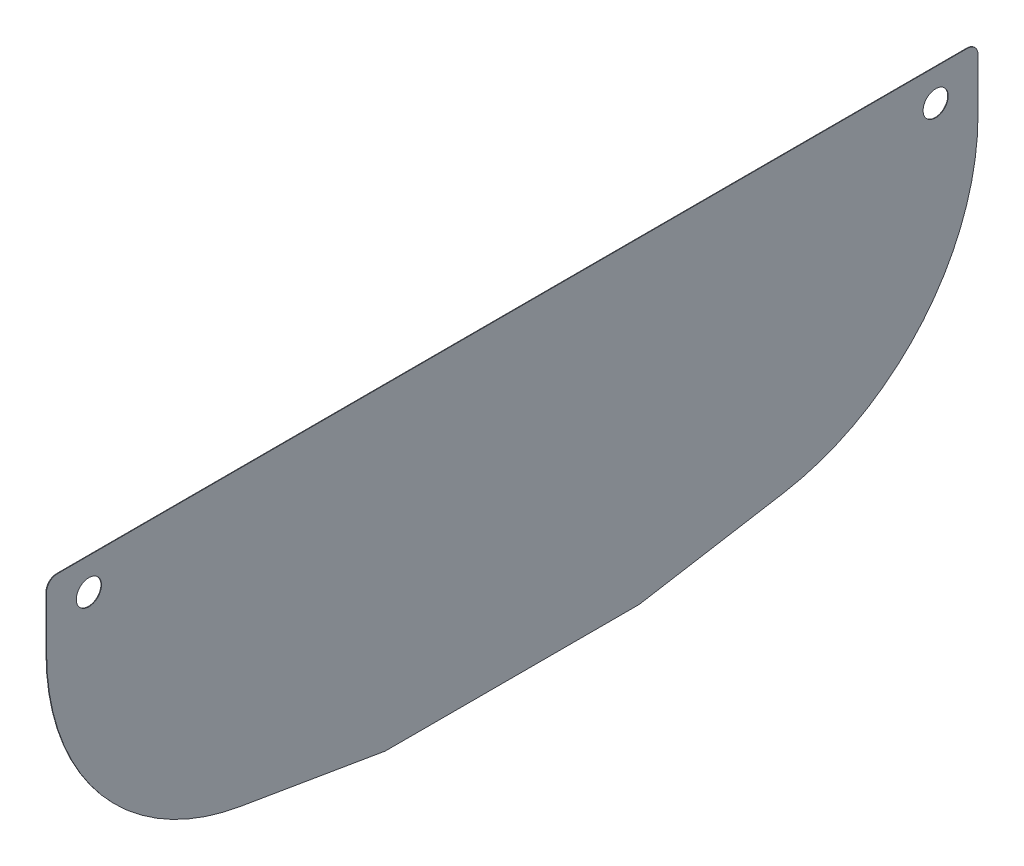
ISO-10303-21;
HEADER;
FILE_DESCRIPTION(('STEP AP214'),'2;1');
FILE_NAME('part.step','',(''),(''),'','','');
FILE_SCHEMA(('AUTOMOTIVE_DESIGN { 1 0 10303 214 1 1 1 1 }'));
ENDSEC;
DATA;
#1=APPLICATION_CONTEXT('core data for automotive mechanical design processes');
#2=APPLICATION_PROTOCOL_DEFINITION('international standard','automotive_design',2000,#1);
#3=PRODUCT_CONTEXT('',#1,'mechanical');
#4=PRODUCT('Part','Part','',(#3));
#5=PRODUCT_RELATED_PRODUCT_CATEGORY('part','',(#4));
#6=PRODUCT_DEFINITION_FORMATION('','',#4);
#7=PRODUCT_DEFINITION_CONTEXT('part definition',#1,'design');
#8=PRODUCT_DEFINITION('design','',#6,#7);
#9=PRODUCT_DEFINITION_SHAPE('','',#8);
#10=(LENGTH_UNIT() NAMED_UNIT(*) SI_UNIT(.MILLI.,.METRE.));
#11=(NAMED_UNIT(*) PLANE_ANGLE_UNIT() SI_UNIT($,.RADIAN.));
#12=(NAMED_UNIT(*) SI_UNIT($,.STERADIAN.) SOLID_ANGLE_UNIT());
#13=UNCERTAINTY_MEASURE_WITH_UNIT(LENGTH_MEASURE(1.E-05),#10,'distance_accuracy_value','');
#14=(GEOMETRIC_REPRESENTATION_CONTEXT(3) GLOBAL_UNCERTAINTY_ASSIGNED_CONTEXT((#13)) GLOBAL_UNIT_ASSIGNED_CONTEXT((#10,
#11,#12)) REPRESENTATION_CONTEXT('',''));
#15=CARTESIAN_POINT('',(0.,0.,0.));
#16=DIRECTION('',(0.,0.,1.));
#17=DIRECTION('',(1.,0.,0.));
#18=AXIS2_PLACEMENT_3D('',#15,#16,#17);
#19=CARTESIAN_POINT('',(0.635,609.6,-279.4));
#20=DIRECTION('',(1.,0.,0.));
#21=DIRECTION('',(0.,0.,-1.));
#22=AXIS2_PLACEMENT_3D('',#19,#20,#21);
#23=PLANE('',#22);
#24=CARTESIAN_POINT('',(0.635,647.7,508.));
#25=DIRECTION('',(1.,0.,0.));
#26=DIRECTION('',(0.,0.,-1.));
#27=AXIS2_PLACEMENT_3D('',#24,#25,#26);
#28=CIRCLE('',#27,15.08125);
#29=CARTESIAN_POINT('',(0.635,647.7,492.91875));
#30=VERTEX_POINT('',#29);
#31=EDGE_CURVE('E240',#30,#30,#28,.T.);
#32=ORIENTED_EDGE('',*,*,#31,.F.);
#33=EDGE_LOOP('',(#32));
#34=FACE_BOUND('',#33,.T.);
#35=DIRECTION('',(0.,0.,-1.));
#36=VECTOR('',#35,1.);
#37=CARTESIAN_POINT('',(0.635,304.8,-152.4));
#38=LINE('',#37,#36);
#39=CARTESIAN_POINT('',(0.635,304.8,151.335296477196));
#40=VERTEX_POINT('',#39);
#41=CARTESIAN_POINT('',(0.635,304.8,-151.335296477196));
#42=VERTEX_POINT('',#41);
#43=EDGE_CURVE('E233',#40,#42,#38,.T.);
#44=ORIENTED_EDGE('',*,*,#43,.T.);
#45=CARTESIAN_POINT('',(0.635,317.5,-151.335296477196));
#46=DIRECTION('',(1.,0.,0.));
#47=DIRECTION('',(0.,0.,-1.));
#48=AXIS2_PLACEMENT_3D('',#45,#46,#47);
#49=CIRCLE('',#48,12.7);
#50=CARTESIAN_POINT('',(0.635,304.977272750754,-153.449841875385));
#51=VERTEX_POINT('',#50);
#52=EDGE_CURVE('E179',#42,#51,#49,.T.);
#53=ORIENTED_EDGE('',*,*,#52,.T.);
#54=DIRECTION('',(0.,0.166499637652699,-0.986041515688625));
#55=VECTOR('',#54,1.);
#56=CARTESIAN_POINT('',(0.635,304.8,-152.4));
#57=LINE('',#56,#55);
#58=CARTESIAN_POINT('',(0.635,334.100000516598,-325.919998760164));
#59=VERTEX_POINT('',#58);
#60=EDGE_CURVE('E142',#51,#59,#57,.T.);
#61=ORIENTED_EDGE('',*,*,#60,.T.);
#62=CARTESIAN_POINT('',(0.635,609.6,-279.4));
#63=DIRECTION('',(1.,0.,0.));
#64=DIRECTION('',(0.,0.,-1.));
#65=AXIS2_PLACEMENT_3D('',#62,#63,#64);
#66=CIRCLE('',#65,279.4);
#67=CARTESIAN_POINT('',(0.635,609.6,-558.8));
#68=VERTEX_POINT('',#67);
#69=EDGE_CURVE('E136',#59,#68,#66,.T.);
#70=ORIENTED_EDGE('',*,*,#69,.T.);
#71=DIRECTION('',(0.,1.,0.));
#72=VECTOR('',#71,1.);
#73=CARTESIAN_POINT('',(0.635,685.8,-558.8));
#74=LINE('',#73,#72);
#75=CARTESIAN_POINT('',(0.635,673.1,-558.8));
#76=VERTEX_POINT('',#75);
#77=EDGE_CURVE('E126',#68,#76,#74,.T.);
#78=ORIENTED_EDGE('',*,*,#77,.T.);
#79=CARTESIAN_POINT('',(0.635,673.1,-546.1));
#80=DIRECTION('',(1.,0.,0.));
#81=DIRECTION('',(0.,0.,-1.));
#82=AXIS2_PLACEMENT_3D('',#79,#80,#81);
#83=CIRCLE('',#82,12.7);
#84=CARTESIAN_POINT('',(0.635,685.8,-546.1));
#85=VERTEX_POINT('',#84);
#86=EDGE_CURVE('E175',#76,#85,#83,.T.);
#87=ORIENTED_EDGE('',*,*,#86,.T.);
#88=DIRECTION('',(0.,0.,1.));
#89=VECTOR('',#88,1.);
#90=CARTESIAN_POINT('',(0.635,685.8,558.8));
#91=LINE('',#90,#89);
#92=CARTESIAN_POINT('',(0.635,685.8,546.1));
#93=VERTEX_POINT('',#92);
#94=EDGE_CURVE('E135',#85,#93,#91,.T.);
#95=ORIENTED_EDGE('',*,*,#94,.T.);
#96=CARTESIAN_POINT('',(0.635,673.1,546.1));
#97=DIRECTION('',(1.,0.,0.));
#98=DIRECTION('',(0.,0.,-1.));
#99=AXIS2_PLACEMENT_3D('',#96,#97,#98);
#100=CIRCLE('',#99,12.7);
#101=CARTESIAN_POINT('',(0.635,673.1,558.8));
#102=VERTEX_POINT('',#101);
#103=EDGE_CURVE('E57',#93,#102,#100,.T.);
#104=ORIENTED_EDGE('',*,*,#103,.T.);
#105=DIRECTION('',(0.,-1.,0.));
#106=VECTOR('',#105,1.);
#107=CARTESIAN_POINT('',(0.635,609.6,558.8));
#108=LINE('',#107,#106);
#109=CARTESIAN_POINT('',(0.635,609.6,558.8));
#110=VERTEX_POINT('',#109);
#111=EDGE_CURVE('E254',#102,#110,#108,.T.);
#112=ORIENTED_EDGE('',*,*,#111,.T.);
#113=CARTESIAN_POINT('',(0.635,609.6,279.4));
#114=DIRECTION('',(1.,0.,0.));
#115=DIRECTION('',(0.,0.,1.));
#116=AXIS2_PLACEMENT_3D('',#113,#114,#115);
#117=CIRCLE('',#116,279.4);
#118=CARTESIAN_POINT('',(0.635,334.100000516598,325.919998760164));
#119=VERTEX_POINT('',#118);
#120=EDGE_CURVE('E237',#110,#119,#117,.T.);
#121=ORIENTED_EDGE('',*,*,#120,.T.);
#122=DIRECTION('',(0.,-0.166499637652699,-0.986041515688625));
#123=VECTOR('',#122,1.);
#124=CARTESIAN_POINT('',(0.635,304.8,152.4));
#125=LINE('',#124,#123);
#126=CARTESIAN_POINT('',(0.635,304.977272750754,153.449841875385));
#127=VERTEX_POINT('',#126);
#128=EDGE_CURVE('E220',#119,#127,#125,.T.);
#129=ORIENTED_EDGE('',*,*,#128,.T.);
#130=CARTESIAN_POINT('',(0.635,317.5,151.335296477196));
#131=DIRECTION('',(1.,0.,0.));
#132=DIRECTION('',(0.,0.,-1.));
#133=AXIS2_PLACEMENT_3D('',#130,#131,#132);
#134=CIRCLE('',#133,12.7);
#135=EDGE_CURVE('E177',#127,#40,#134,.T.);
#136=ORIENTED_EDGE('',*,*,#135,.T.);
#137=EDGE_LOOP('',(#44,#53,#61,#70,#78,#87,#95,#104,#112,#121,#129,#136));
#138=FACE_BOUND('',#137,.T.);
#139=CARTESIAN_POINT('',(0.635,647.7,-508.));
#140=DIRECTION('',(1.,0.,0.));
#141=DIRECTION('',(0.,0.,-1.));
#142=AXIS2_PLACEMENT_3D('',#139,#140,#141);
#143=CIRCLE('',#142,15.0812500000001);
#144=CARTESIAN_POINT('',(0.635,647.7,-523.08125));
#145=VERTEX_POINT('',#144);
#146=EDGE_CURVE('E247',#145,#145,#143,.T.);
#147=ORIENTED_EDGE('',*,*,#146,.F.);
#148=EDGE_LOOP('',(#147));
#149=FACE_BOUND('',#148,.T.);
#150=ADVANCED_FACE('F34',(#34,#138,#149),#23,.T.);
#151=CARTESIAN_POINT('',(0.,609.6,-279.4));
#152=DIRECTION('',(1.,0.,0.));
#153=DIRECTION('',(0.,0.,-1.));
#154=AXIS2_PLACEMENT_3D('',#151,#152,#153);
#155=PLANE('',#154);
#156=DIRECTION('',(0.,0.166499637652699,-0.986041515688625));
#157=VECTOR('',#156,1.);
#158=CARTESIAN_POINT('',(0.,304.8,-152.4));
#159=LINE('',#158,#157);
#160=CARTESIAN_POINT('',(0.,304.977272750754,-153.449841875385));
#161=VERTEX_POINT('',#160);
#162=CARTESIAN_POINT('',(0.,334.100000516598,-325.919998760164));
#163=VERTEX_POINT('',#162);
#164=EDGE_CURVE('E146',#161,#163,#159,.T.);
#165=ORIENTED_EDGE('',*,*,#164,.F.);
#166=CARTESIAN_POINT('',(0.,317.5,-151.335296477196));
#167=DIRECTION('',(1.,0.,0.));
#168=DIRECTION('',(0.,0.,-1.));
#169=AXIS2_PLACEMENT_3D('',#166,#167,#168);
#170=CIRCLE('',#169,12.7);
#171=CARTESIAN_POINT('',(0.,304.8,-151.335296477196));
#172=VERTEX_POINT('',#171);
#173=EDGE_CURVE('E167',#161,#172,#170,.F.);
#174=ORIENTED_EDGE('',*,*,#173,.T.);
#175=DIRECTION('',(0.,0.,-1.));
#176=VECTOR('',#175,1.);
#177=CARTESIAN_POINT('',(0.,304.8,-152.4));
#178=LINE('',#177,#176);
#179=CARTESIAN_POINT('',(0.,304.8,151.335296477196));
#180=VERTEX_POINT('',#179);
#181=EDGE_CURVE('E211',#180,#172,#178,.T.);
#182=ORIENTED_EDGE('',*,*,#181,.F.);
#183=CARTESIAN_POINT('',(0.,317.5,151.335296477196));
#184=DIRECTION('',(1.,0.,0.));
#185=DIRECTION('',(0.,0.,-1.));
#186=AXIS2_PLACEMENT_3D('',#183,#184,#185);
#187=CIRCLE('',#186,12.7);
#188=CARTESIAN_POINT('',(0.,304.977272750754,153.449841875385));
#189=VERTEX_POINT('',#188);
#190=EDGE_CURVE('E165',#180,#189,#187,.F.);
#191=ORIENTED_EDGE('',*,*,#190,.T.);
#192=DIRECTION('',(0.,-0.166499637652699,-0.986041515688625));
#193=VECTOR('',#192,1.);
#194=CARTESIAN_POINT('',(0.,304.8,152.4));
#195=LINE('',#194,#193);
#196=CARTESIAN_POINT('',(0.,334.100000516598,325.919998760164));
#197=VERTEX_POINT('',#196);
#198=EDGE_CURVE('E209',#197,#189,#195,.T.);
#199=ORIENTED_EDGE('',*,*,#198,.F.);
#200=CARTESIAN_POINT('',(0.,609.6,279.4));
#201=DIRECTION('',(1.,0.,0.));
#202=DIRECTION('',(0.,0.,1.));
#203=AXIS2_PLACEMENT_3D('',#200,#201,#202);
#204=CIRCLE('',#203,279.4);
#205=CARTESIAN_POINT('',(0.,609.6,558.8));
#206=VERTEX_POINT('',#205);
#207=EDGE_CURVE('E203',#206,#197,#204,.T.);
#208=ORIENTED_EDGE('',*,*,#207,.F.);
#209=DIRECTION('',(0.,-1.,0.));
#210=VECTOR('',#209,1.);
#211=CARTESIAN_POINT('',(0.,609.6,558.8));
#212=LINE('',#211,#210);
#213=CARTESIAN_POINT('',(0.,673.1,558.8));
#214=VERTEX_POINT('',#213);
#215=EDGE_CURVE('E200',#214,#206,#212,.T.);
#216=ORIENTED_EDGE('',*,*,#215,.F.);
#217=CARTESIAN_POINT('',(0.,673.1,546.1));
#218=DIRECTION('',(1.,0.,0.));
#219=DIRECTION('',(0.,0.,-1.));
#220=AXIS2_PLACEMENT_3D('',#217,#218,#219);
#221=CIRCLE('',#220,12.7);
#222=CARTESIAN_POINT('',(0.,685.8,546.1));
#223=VERTEX_POINT('',#222);
#224=EDGE_CURVE('E155',#214,#223,#221,.F.);
#225=ORIENTED_EDGE('',*,*,#224,.T.);
#226=DIRECTION('',(0.,0.,1.));
#227=VECTOR('',#226,1.);
#228=CARTESIAN_POINT('',(0.,685.8,558.8));
#229=LINE('',#228,#227);
#230=CARTESIAN_POINT('',(0.,685.8,-546.1));
#231=VERTEX_POINT('',#230);
#232=EDGE_CURVE('E192',#231,#223,#229,.T.);
#233=ORIENTED_EDGE('',*,*,#232,.F.);
#234=CARTESIAN_POINT('',(0.,673.1,-546.1));
#235=DIRECTION('',(1.,0.,0.));
#236=DIRECTION('',(0.,0.,-1.));
#237=AXIS2_PLACEMENT_3D('',#234,#235,#236);
#238=CIRCLE('',#237,12.7);
#239=CARTESIAN_POINT('',(0.,673.1,-558.8));
#240=VERTEX_POINT('',#239);
#241=EDGE_CURVE('E163',#231,#240,#238,.F.);
#242=ORIENTED_EDGE('',*,*,#241,.T.);
#243=DIRECTION('',(0.,1.,0.));
#244=VECTOR('',#243,1.);
#245=CARTESIAN_POINT('',(0.,685.8,-558.8));
#246=LINE('',#245,#244);
#247=CARTESIAN_POINT('',(0.,609.6,-558.8));
#248=VERTEX_POINT('',#247);
#249=EDGE_CURVE('E201',#248,#240,#246,.T.);
#250=ORIENTED_EDGE('',*,*,#249,.F.);
#251=CARTESIAN_POINT('',(0.,609.6,-279.4));
#252=DIRECTION('',(1.,0.,0.));
#253=DIRECTION('',(0.,0.,-1.));
#254=AXIS2_PLACEMENT_3D('',#251,#252,#253);
#255=CIRCLE('',#254,279.4);
#256=EDGE_CURVE('E150',#163,#248,#255,.T.);
#257=ORIENTED_EDGE('',*,*,#256,.F.);
#258=EDGE_LOOP('',(#165,#174,#182,#191,#199,#208,#216,#225,#233,#242,#250,#257));
#259=FACE_BOUND('',#258,.T.);
#260=CARTESIAN_POINT('',(0.,647.7,508.));
#261=DIRECTION('',(1.,0.,0.));
#262=DIRECTION('',(0.,0.,-1.));
#263=AXIS2_PLACEMENT_3D('',#260,#261,#262);
#264=CIRCLE('',#263,15.08125);
#265=CARTESIAN_POINT('',(0.,647.7,492.91875));
#266=VERTEX_POINT('',#265);
#267=EDGE_CURVE('E242',#266,#266,#264,.T.);
#268=ORIENTED_EDGE('',*,*,#267,.T.);
#269=EDGE_LOOP('',(#268));
#270=FACE_BOUND('',#269,.T.);
#271=CARTESIAN_POINT('',(0.,647.7,-508.));
#272=DIRECTION('',(1.,0.,0.));
#273=DIRECTION('',(0.,0.,-1.));
#274=AXIS2_PLACEMENT_3D('',#271,#272,#273);
#275=CIRCLE('',#274,15.0812500000001);
#276=CARTESIAN_POINT('',(0.,647.7,-523.08125));
#277=VERTEX_POINT('',#276);
#278=EDGE_CURVE('E250',#277,#277,#275,.T.);
#279=ORIENTED_EDGE('',*,*,#278,.T.);
#280=EDGE_LOOP('',(#279));
#281=FACE_BOUND('',#280,.T.);
#282=ADVANCED_FACE('F197',(#259,#270,#281),#155,.F.);
#283=CARTESIAN_POINT('',(0.635,609.6,-279.4));
#284=DIRECTION('',(-1.,0.,0.));
#285=DIRECTION('',(0.,0.,1.));
#286=AXIS2_PLACEMENT_3D('',#283,#284,#285);
#287=CYLINDRICAL_SURFACE('',#286,279.4);
#288=ORIENTED_EDGE('',*,*,#256,.T.);
#289=DIRECTION('',(-1.,0.,0.));
#290=VECTOR('',#289,1.);
#291=CARTESIAN_POINT('',(0.635,609.6,-558.8));
#292=LINE('',#291,#290);
#293=EDGE_CURVE('E131',#68,#248,#292,.T.);
#294=ORIENTED_EDGE('',*,*,#293,.F.);
#295=ORIENTED_EDGE('',*,*,#69,.F.);
#296=DIRECTION('',(-1.,0.,0.));
#297=VECTOR('',#296,1.);
#298=CARTESIAN_POINT('',(0.635,334.100000516598,-325.919998760164));
#299=LINE('',#298,#297);
#300=EDGE_CURVE('E215',#59,#163,#299,.T.);
#301=ORIENTED_EDGE('',*,*,#300,.T.);
#302=EDGE_LOOP('',(#288,#294,#295,#301));
#303=FACE_BOUND('',#302,.T.);
#304=ADVANCED_FACE('F148',(#303),#287,.T.);
#305=CARTESIAN_POINT('',(0.635,685.8,-558.8));
#306=DIRECTION('',(0.,0.,1.));
#307=DIRECTION('',(0.,-1.,0.));
#308=AXIS2_PLACEMENT_3D('',#305,#306,#307);
#309=PLANE('',#308);
#310=ORIENTED_EDGE('',*,*,#249,.T.);
#311=DIRECTION('',(-1.,0.,0.));
#312=VECTOR('',#311,1.);
#313=CARTESIAN_POINT('',(0.635,673.1,-558.8));
#314=LINE('',#313,#312);
#315=EDGE_CURVE('E42',#240,#76,#314,.F.);
#316=ORIENTED_EDGE('',*,*,#315,.T.);
#317=ORIENTED_EDGE('',*,*,#77,.F.);
#318=ORIENTED_EDGE('',*,*,#293,.T.);
#319=EDGE_LOOP('',(#310,#316,#317,#318));
#320=FACE_BOUND('',#319,.T.);
#321=ADVANCED_FACE('F129',(#320),#309,.F.);
#322=CARTESIAN_POINT('',(0.635,685.8,558.8));
#323=DIRECTION('',(0.,-1.,0.));
#324=DIRECTION('',(0.,0.,-1.));
#325=AXIS2_PLACEMENT_3D('',#322,#323,#324);
#326=PLANE('',#325);
#327=ORIENTED_EDGE('',*,*,#94,.F.);
#328=DIRECTION('',(-1.,0.,0.));
#329=VECTOR('',#328,1.);
#330=CARTESIAN_POINT('',(0.635,685.8,-546.1));
#331=LINE('',#330,#329);
#332=EDGE_CURVE('E184',#85,#231,#331,.T.);
#333=ORIENTED_EDGE('',*,*,#332,.T.);
#334=ORIENTED_EDGE('',*,*,#232,.T.);
#335=DIRECTION('',(-1.,0.,0.));
#336=VECTOR('',#335,1.);
#337=CARTESIAN_POINT('',(0.635,685.8,546.1));
#338=LINE('',#337,#336);
#339=EDGE_CURVE('E182',#223,#93,#338,.F.);
#340=ORIENTED_EDGE('',*,*,#339,.T.);
#341=EDGE_LOOP('',(#327,#333,#334,#340));
#342=FACE_BOUND('',#341,.T.);
#343=ADVANCED_FACE('F191',(#342),#326,.F.);
#344=CARTESIAN_POINT('',(0.635,609.6,558.8));
#345=DIRECTION('',(0.,0.,-1.));
#346=DIRECTION('',(0.,1.,0.));
#347=AXIS2_PLACEMENT_3D('',#344,#345,#346);
#348=PLANE('',#347);
#349=ORIENTED_EDGE('',*,*,#111,.F.);
#350=DIRECTION('',(-1.,0.,0.));
#351=VECTOR('',#350,1.);
#352=CARTESIAN_POINT('',(0.635,673.1,558.8));
#353=LINE('',#352,#351);
#354=EDGE_CURVE('E11',#102,#214,#353,.T.);
#355=ORIENTED_EDGE('',*,*,#354,.T.);
#356=ORIENTED_EDGE('',*,*,#215,.T.);
#357=DIRECTION('',(-1.,0.,0.));
#358=VECTOR('',#357,1.);
#359=CARTESIAN_POINT('',(0.635,609.6,558.8));
#360=LINE('',#359,#358);
#361=EDGE_CURVE('E152',#110,#206,#360,.T.);
#362=ORIENTED_EDGE('',*,*,#361,.F.);
#363=EDGE_LOOP('',(#349,#355,#356,#362));
#364=FACE_BOUND('',#363,.T.);
#365=ADVANCED_FACE('F258',(#364),#348,.F.);
#366=CARTESIAN_POINT('',(0.635,609.6,279.4));
#367=DIRECTION('',(-1.,0.,0.));
#368=DIRECTION('',(0.,0.,1.));
#369=AXIS2_PLACEMENT_3D('',#366,#367,#368);
#370=CYLINDRICAL_SURFACE('',#369,279.4);
#371=ORIENTED_EDGE('',*,*,#207,.T.);
#372=DIRECTION('',(-1.,0.,0.));
#373=VECTOR('',#372,1.);
#374=CARTESIAN_POINT('',(0.635,334.100000516598,325.919998760164));
#375=LINE('',#374,#373);
#376=EDGE_CURVE('E158',#119,#197,#375,.T.);
#377=ORIENTED_EDGE('',*,*,#376,.F.);
#378=ORIENTED_EDGE('',*,*,#120,.F.);
#379=ORIENTED_EDGE('',*,*,#361,.T.);
#380=EDGE_LOOP('',(#371,#377,#378,#379));
#381=FACE_BOUND('',#380,.T.);
#382=ADVANCED_FACE('F256',(#381),#370,.T.);
#383=CARTESIAN_POINT('',(0.635,304.8,152.4));
#384=DIRECTION('',(0.,0.986041515688624,-0.166499637652699));
#385=DIRECTION('',(0.,0.166499637652699,0.986041515688625));
#386=AXIS2_PLACEMENT_3D('',#383,#384,#385);
#387=PLANE('',#386);
#388=ORIENTED_EDGE('',*,*,#198,.T.);
#389=DIRECTION('',(-1.,0.,0.));
#390=VECTOR('',#389,1.);
#391=CARTESIAN_POINT('',(0.635,304.977272750754,153.449841875385));
#392=LINE('',#391,#390);
#393=EDGE_CURVE('E49',#189,#127,#392,.F.);
#394=ORIENTED_EDGE('',*,*,#393,.T.);
#395=ORIENTED_EDGE('',*,*,#128,.F.);
#396=ORIENTED_EDGE('',*,*,#376,.T.);
#397=EDGE_LOOP('',(#388,#394,#395,#396));
#398=FACE_BOUND('',#397,.T.);
#399=ADVANCED_FACE('F219',(#398),#387,.F.);
#400=CARTESIAN_POINT('',(0.635,304.8,-152.4));
#401=DIRECTION('',(0.,1.,0.));
#402=DIRECTION('',(0.,0.,1.));
#403=AXIS2_PLACEMENT_3D('',#400,#401,#402);
#404=PLANE('',#403);
#405=ORIENTED_EDGE('',*,*,#181,.T.);
#406=DIRECTION('',(-1.,0.,0.));
#407=VECTOR('',#406,1.);
#408=CARTESIAN_POINT('',(0.635,304.8,-151.335296477196));
#409=LINE('',#408,#407);
#410=EDGE_CURVE('E172',#172,#42,#409,.F.);
#411=ORIENTED_EDGE('',*,*,#410,.T.);
#412=ORIENTED_EDGE('',*,*,#43,.F.);
#413=DIRECTION('',(-1.,0.,0.));
#414=VECTOR('',#413,1.);
#415=CARTESIAN_POINT('',(0.635,304.8,151.335296477196));
#416=LINE('',#415,#414);
#417=EDGE_CURVE('E169',#40,#180,#416,.T.);
#418=ORIENTED_EDGE('',*,*,#417,.T.);
#419=EDGE_LOOP('',(#405,#411,#412,#418));
#420=FACE_BOUND('',#419,.T.);
#421=ADVANCED_FACE('F231',(#420),#404,.F.);
#422=CARTESIAN_POINT('',(0.635,304.8,-152.4));
#423=DIRECTION('',(0.,0.986041515688624,0.166499637652699));
#424=DIRECTION('',(0.,-0.166499637652699,0.986041515688625));
#425=AXIS2_PLACEMENT_3D('',#422,#423,#424);
#426=PLANE('',#425);
#427=ORIENTED_EDGE('',*,*,#60,.F.);
#428=DIRECTION('',(-1.,0.,0.));
#429=VECTOR('',#428,1.);
#430=CARTESIAN_POINT('',(0.635,304.977272750754,-153.449841875385));
#431=LINE('',#430,#429);
#432=EDGE_CURVE('E151',#51,#161,#431,.T.);
#433=ORIENTED_EDGE('',*,*,#432,.T.);
#434=ORIENTED_EDGE('',*,*,#164,.T.);
#435=ORIENTED_EDGE('',*,*,#300,.F.);
#436=EDGE_LOOP('',(#427,#433,#434,#435));
#437=FACE_BOUND('',#436,.T.);
#438=ADVANCED_FACE('F280',(#437),#426,.F.);
#439=CARTESIAN_POINT('',(0.635,647.7,508.));
#440=DIRECTION('',(-1.,0.,0.));
#441=DIRECTION('',(0.,0.,1.));
#442=AXIS2_PLACEMENT_3D('',#439,#440,#441);
#443=CYLINDRICAL_SURFACE('',#442,15.08125);
#444=ORIENTED_EDGE('',*,*,#31,.T.);
#445=EDGE_LOOP('',(#444));
#446=FACE_BOUND('',#445,.T.);
#447=ORIENTED_EDGE('',*,*,#267,.F.);
#448=EDGE_LOOP('',(#447));
#449=FACE_BOUND('',#448,.T.);
#450=ADVANCED_FACE('F277',(#446,#449),#443,.F.);
#451=CARTESIAN_POINT('',(0.635,647.7,-508.));
#452=DIRECTION('',(-1.,0.,0.));
#453=DIRECTION('',(0.,0.,1.));
#454=AXIS2_PLACEMENT_3D('',#451,#452,#453);
#455=CYLINDRICAL_SURFACE('',#454,15.0812500000001);
#456=ORIENTED_EDGE('',*,*,#146,.T.);
#457=EDGE_LOOP('',(#456));
#458=FACE_BOUND('',#457,.T.);
#459=ORIENTED_EDGE('',*,*,#278,.F.);
#460=EDGE_LOOP('',(#459));
#461=FACE_BOUND('',#460,.T.);
#462=ADVANCED_FACE('F299',(#458,#461),#455,.F.);
#463=CARTESIAN_POINT('',(0.635,317.5,-151.335296477196));
#464=DIRECTION('',(-1.,0.,0.));
#465=DIRECTION('',(0.,0.,1.));
#466=AXIS2_PLACEMENT_3D('',#463,#464,#465);
#467=CYLINDRICAL_SURFACE('',#466,12.7);
#468=ORIENTED_EDGE('',*,*,#52,.F.);
#469=ORIENTED_EDGE('',*,*,#410,.F.);
#470=ORIENTED_EDGE('',*,*,#173,.F.);
#471=ORIENTED_EDGE('',*,*,#432,.F.);
#472=EDGE_LOOP('',(#468,#469,#470,#471));
#473=FACE_BOUND('',#472,.T.);
#474=ADVANCED_FACE('F267',(#473),#467,.T.);
#475=CARTESIAN_POINT('',(0.635,317.5,151.335296477196));
#476=DIRECTION('',(-1.,0.,0.));
#477=DIRECTION('',(0.,0.,1.));
#478=AXIS2_PLACEMENT_3D('',#475,#476,#477);
#479=CYLINDRICAL_SURFACE('',#478,12.7);
#480=ORIENTED_EDGE('',*,*,#135,.F.);
#481=ORIENTED_EDGE('',*,*,#393,.F.);
#482=ORIENTED_EDGE('',*,*,#190,.F.);
#483=ORIENTED_EDGE('',*,*,#417,.F.);
#484=EDGE_LOOP('',(#480,#481,#482,#483));
#485=FACE_BOUND('',#484,.T.);
#486=ADVANCED_FACE('F228',(#485),#479,.T.);
#487=CARTESIAN_POINT('',(0.635,673.1,-546.1));
#488=DIRECTION('',(-1.,0.,0.));
#489=DIRECTION('',(0.,0.,1.));
#490=AXIS2_PLACEMENT_3D('',#487,#488,#489);
#491=CYLINDRICAL_SURFACE('',#490,12.7);
#492=ORIENTED_EDGE('',*,*,#86,.F.);
#493=ORIENTED_EDGE('',*,*,#315,.F.);
#494=ORIENTED_EDGE('',*,*,#241,.F.);
#495=ORIENTED_EDGE('',*,*,#332,.F.);
#496=EDGE_LOOP('',(#492,#493,#494,#495));
#497=FACE_BOUND('',#496,.T.);
#498=ADVANCED_FACE('F261',(#497),#491,.T.);
#499=CARTESIAN_POINT('',(0.635,673.1,546.1));
#500=DIRECTION('',(-1.,0.,0.));
#501=DIRECTION('',(0.,0.,1.));
#502=AXIS2_PLACEMENT_3D('',#499,#500,#501);
#503=CYLINDRICAL_SURFACE('',#502,12.7);
#504=ORIENTED_EDGE('',*,*,#103,.F.);
#505=ORIENTED_EDGE('',*,*,#339,.F.);
#506=ORIENTED_EDGE('',*,*,#224,.F.);
#507=ORIENTED_EDGE('',*,*,#354,.F.);
#508=EDGE_LOOP('',(#504,#505,#506,#507));
#509=FACE_BOUND('',#508,.T.);
#510=ADVANCED_FACE('F36',(#509),#503,.T.);
#511=CLOSED_SHELL('',(#150,#282,#304,#321,#343,#365,#382,#399,#421,#438,#450,#462,#474,#486,
#498,#510));
#512=MANIFOLD_SOLID_BREP('B2',#511);
#513=ADVANCED_BREP_SHAPE_REPRESENTATION('',(#18,#512),#14);
#514=SHAPE_DEFINITION_REPRESENTATION(#9,#513);
ENDSEC;
END-ISO-10303-21;
